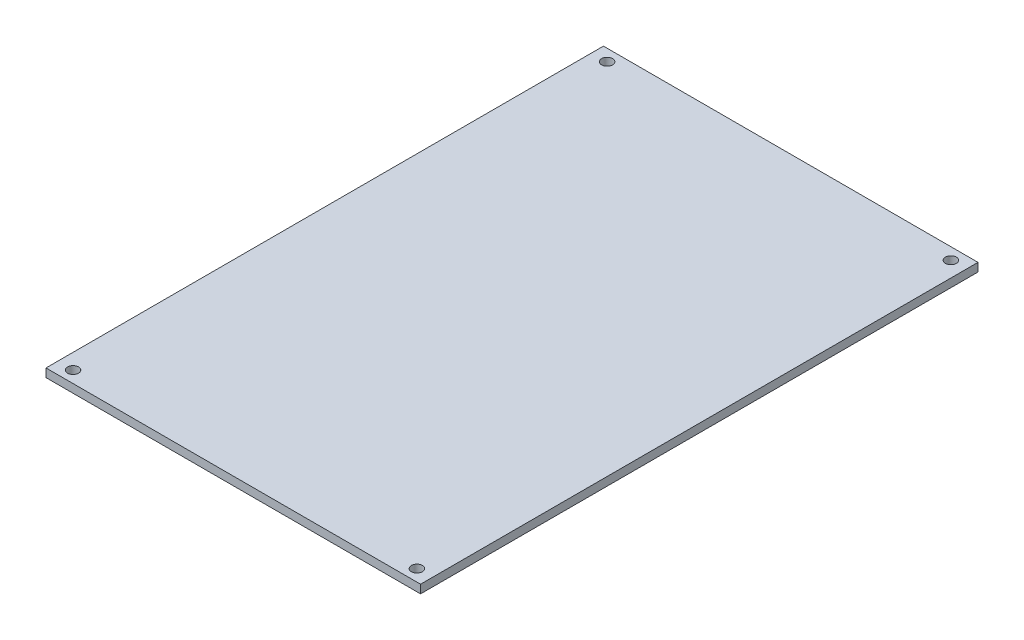
ISO-10303-21;
HEADER;
FILE_DESCRIPTION(('STEP AP214'),'2;1');
FILE_NAME('part.step','',(''),(''),'','','');
FILE_SCHEMA(('AUTOMOTIVE_DESIGN { 1 0 10303 214 1 1 1 1 }'));
ENDSEC;
DATA;
#1=APPLICATION_CONTEXT('core data for automotive mechanical design processes');
#2=APPLICATION_PROTOCOL_DEFINITION('international standard','automotive_design',2000,#1);
#3=PRODUCT_CONTEXT('',#1,'mechanical');
#4=PRODUCT('Part','Part','',(#3));
#5=PRODUCT_RELATED_PRODUCT_CATEGORY('part','',(#4));
#6=PRODUCT_DEFINITION_FORMATION('','',#4);
#7=PRODUCT_DEFINITION_CONTEXT('part definition',#1,'design');
#8=PRODUCT_DEFINITION('design','',#6,#7);
#9=PRODUCT_DEFINITION_SHAPE('','',#8);
#10=(LENGTH_UNIT() NAMED_UNIT(*) SI_UNIT(.MILLI.,.METRE.));
#11=(NAMED_UNIT(*) PLANE_ANGLE_UNIT() SI_UNIT($,.RADIAN.));
#12=(NAMED_UNIT(*) SI_UNIT($,.STERADIAN.) SOLID_ANGLE_UNIT());
#13=UNCERTAINTY_MEASURE_WITH_UNIT(LENGTH_MEASURE(1.E-05),#10,'distance_accuracy_value','');
#14=(GEOMETRIC_REPRESENTATION_CONTEXT(3) GLOBAL_UNCERTAINTY_ASSIGNED_CONTEXT((#13)) GLOBAL_UNIT_ASSIGNED_CONTEXT((#10,
#11,#12)) REPRESENTATION_CONTEXT('',''));
#15=CARTESIAN_POINT('',(0.,0.,0.));
#16=DIRECTION('',(0.,0.,1.));
#17=DIRECTION('',(1.,0.,0.));
#18=AXIS2_PLACEMENT_3D('',#15,#16,#17);
#19=CARTESIAN_POINT('',(51.2,2.3,76.2));
#20=DIRECTION('',(-1.,0.,0.));
#21=DIRECTION('',(0.,0.,1.));
#22=AXIS2_PLACEMENT_3D('',#19,#20,#21);
#23=PLANE('',#22);
#24=DIRECTION('',(0.,0.,-1.));
#25=VECTOR('',#24,1.);
#26=CARTESIAN_POINT('',(51.2,0.,76.2));
#27=LINE('',#26,#25);
#28=CARTESIAN_POINT('',(51.2,0.,76.2));
#29=VERTEX_POINT('',#28);
#30=CARTESIAN_POINT('',(51.2,0.,-76.2));
#31=VERTEX_POINT('',#30);
#32=EDGE_CURVE('E97',#29,#31,#27,.T.);
#33=ORIENTED_EDGE('',*,*,#32,.T.);
#34=DIRECTION('',(0.,-1.,0.));
#35=VECTOR('',#34,1.);
#36=CARTESIAN_POINT('',(51.2,2.3,-76.2));
#37=LINE('',#36,#35);
#38=CARTESIAN_POINT('',(51.2,2.3,-76.2));
#39=VERTEX_POINT('',#38);
#40=EDGE_CURVE('E11',#39,#31,#37,.T.);
#41=ORIENTED_EDGE('',*,*,#40,.F.);
#42=DIRECTION('',(0.,0.,-1.));
#43=VECTOR('',#42,1.);
#44=CARTESIAN_POINT('',(51.2,2.3,76.2));
#45=LINE('',#44,#43);
#46=CARTESIAN_POINT('',(51.2,2.3,76.2));
#47=VERTEX_POINT('',#46);
#48=EDGE_CURVE('E85',#47,#39,#45,.T.);
#49=ORIENTED_EDGE('',*,*,#48,.F.);
#50=DIRECTION('',(0.,-1.,0.));
#51=VECTOR('',#50,1.);
#52=CARTESIAN_POINT('',(51.2,2.3,76.2));
#53=LINE('',#52,#51);
#54=EDGE_CURVE('E93',#47,#29,#53,.T.);
#55=ORIENTED_EDGE('',*,*,#54,.T.);
#56=EDGE_LOOP('',(#33,#41,#49,#55));
#57=FACE_BOUND('',#56,.T.);
#58=ADVANCED_FACE('F34',(#57),#23,.F.);
#59=CARTESIAN_POINT('',(-51.2,2.3,-76.2));
#60=DIRECTION('',(0.,0.,1.));
#61=DIRECTION('',(1.,0.,0.));
#62=AXIS2_PLACEMENT_3D('',#59,#60,#61);
#63=PLANE('',#62);
#64=DIRECTION('',(-1.,0.,0.));
#65=VECTOR('',#64,1.);
#66=CARTESIAN_POINT('',(-51.2,0.,-76.2));
#67=LINE('',#66,#65);
#68=CARTESIAN_POINT('',(-51.2,0.,-76.2));
#69=VERTEX_POINT('',#68);
#70=EDGE_CURVE('E89',#31,#69,#67,.T.);
#71=ORIENTED_EDGE('',*,*,#70,.T.);
#72=DIRECTION('',(0.,-1.,0.));
#73=VECTOR('',#72,1.);
#74=CARTESIAN_POINT('',(-51.2,2.3,-76.2));
#75=LINE('',#74,#73);
#76=CARTESIAN_POINT('',(-51.2,2.3,-76.2));
#77=VERTEX_POINT('',#76);
#78=EDGE_CURVE('E42',#77,#69,#75,.T.);
#79=ORIENTED_EDGE('',*,*,#78,.F.);
#80=DIRECTION('',(-1.,0.,0.));
#81=VECTOR('',#80,1.);
#82=CARTESIAN_POINT('',(-51.2,2.3,-76.2));
#83=LINE('',#82,#81);
#84=EDGE_CURVE('E80',#39,#77,#83,.T.);
#85=ORIENTED_EDGE('',*,*,#84,.F.);
#86=ORIENTED_EDGE('',*,*,#40,.T.);
#87=EDGE_LOOP('',(#71,#79,#85,#86));
#88=FACE_BOUND('',#87,.T.);
#89=ADVANCED_FACE('F88',(#88),#63,.F.);
#90=CARTESIAN_POINT('',(-51.2,2.3,76.2));
#91=DIRECTION('',(1.,0.,0.));
#92=DIRECTION('',(0.,0.,-1.));
#93=AXIS2_PLACEMENT_3D('',#90,#91,#92);
#94=PLANE('',#93);
#95=DIRECTION('',(0.,0.,1.));
#96=VECTOR('',#95,1.);
#97=CARTESIAN_POINT('',(-51.2,0.,76.2));
#98=LINE('',#97,#96);
#99=CARTESIAN_POINT('',(-51.2,0.,76.2));
#100=VERTEX_POINT('',#99);
#101=EDGE_CURVE('E67',#69,#100,#98,.T.);
#102=ORIENTED_EDGE('',*,*,#101,.T.);
#103=DIRECTION('',(0.,-1.,0.));
#104=VECTOR('',#103,1.);
#105=CARTESIAN_POINT('',(-51.2,2.3,76.2));
#106=LINE('',#105,#104);
#107=CARTESIAN_POINT('',(-51.2,2.3,76.2));
#108=VERTEX_POINT('',#107);
#109=EDGE_CURVE('E90',#108,#100,#106,.T.);
#110=ORIENTED_EDGE('',*,*,#109,.F.);
#111=DIRECTION('',(0.,0.,1.));
#112=VECTOR('',#111,1.);
#113=CARTESIAN_POINT('',(-51.2,2.3,76.2));
#114=LINE('',#113,#112);
#115=EDGE_CURVE('E83',#77,#108,#114,.T.);
#116=ORIENTED_EDGE('',*,*,#115,.F.);
#117=ORIENTED_EDGE('',*,*,#78,.T.);
#118=EDGE_LOOP('',(#102,#110,#116,#117));
#119=FACE_BOUND('',#118,.T.);
#120=ADVANCED_FACE('F91',(#119),#94,.F.);
#121=CARTESIAN_POINT('',(-51.2,2.3,76.2));
#122=DIRECTION('',(0.,0.,-1.));
#123=DIRECTION('',(-1.,0.,0.));
#124=AXIS2_PLACEMENT_3D('',#121,#122,#123);
#125=PLANE('',#124);
#126=DIRECTION('',(1.,0.,0.));
#127=VECTOR('',#126,1.);
#128=CARTESIAN_POINT('',(-51.2,0.,76.2));
#129=LINE('',#128,#127);
#130=EDGE_CURVE('E73',#100,#29,#129,.T.);
#131=ORIENTED_EDGE('',*,*,#130,.T.);
#132=ORIENTED_EDGE('',*,*,#54,.F.);
#133=DIRECTION('',(1.,0.,0.));
#134=VECTOR('',#133,1.);
#135=CARTESIAN_POINT('',(-51.2,2.3,76.2));
#136=LINE('',#135,#134);
#137=EDGE_CURVE('E50',#108,#47,#136,.T.);
#138=ORIENTED_EDGE('',*,*,#137,.F.);
#139=ORIENTED_EDGE('',*,*,#109,.T.);
#140=EDGE_LOOP('',(#131,#132,#138,#139));
#141=FACE_BOUND('',#140,.T.);
#142=ADVANCED_FACE('F105',(#141),#125,.F.);
#143=CARTESIAN_POINT('',(0.,2.3,0.));
#144=DIRECTION('',(0.,-1.,0.));
#145=DIRECTION('',(0.,0.,-1.));
#146=AXIS2_PLACEMENT_3D('',#143,#144,#145);
#147=PLANE('',#146);
#148=CARTESIAN_POINT('',(47.,2.3,-73.));
#149=DIRECTION('',(0.,1.,0.));
#150=DIRECTION('',(0.,0.,-1.));
#151=AXIS2_PLACEMENT_3D('',#148,#149,#150);
#152=CIRCLE('',#151,1.5);
#153=CARTESIAN_POINT('',(47.,2.3,-74.5));
#154=VERTEX_POINT('',#153);
#155=EDGE_CURVE('E129',#154,#154,#152,.T.);
#156=ORIENTED_EDGE('',*,*,#155,.F.);
#157=EDGE_LOOP('',(#156));
#158=FACE_BOUND('',#157,.T.);
#159=CARTESIAN_POINT('',(47.,2.3,73.));
#160=DIRECTION('',(0.,1.,0.));
#161=DIRECTION('',(0.,0.,1.));
#162=AXIS2_PLACEMENT_3D('',#159,#160,#161);
#163=CIRCLE('',#162,1.5);
#164=CARTESIAN_POINT('',(47.,2.3,74.5));
#165=VERTEX_POINT('',#164);
#166=EDGE_CURVE('E123',#165,#165,#163,.T.);
#167=ORIENTED_EDGE('',*,*,#166,.F.);
#168=EDGE_LOOP('',(#167));
#169=FACE_BOUND('',#168,.T.);
#170=CARTESIAN_POINT('',(-47.,2.3,73.));
#171=DIRECTION('',(0.,1.,0.));
#172=DIRECTION('',(0.,0.,-1.));
#173=AXIS2_PLACEMENT_3D('',#170,#171,#172);
#174=CIRCLE('',#173,1.5);
#175=CARTESIAN_POINT('',(-47.,2.3,71.5));
#176=VERTEX_POINT('',#175);
#177=EDGE_CURVE('E117',#176,#176,#174,.T.);
#178=ORIENTED_EDGE('',*,*,#177,.F.);
#179=EDGE_LOOP('',(#178));
#180=FACE_BOUND('',#179,.T.);
#181=CARTESIAN_POINT('',(-47.,2.3,-73.));
#182=DIRECTION('',(0.,1.,0.));
#183=DIRECTION('',(0.,0.,1.));
#184=AXIS2_PLACEMENT_3D('',#181,#182,#183);
#185=CIRCLE('',#184,1.5);
#186=CARTESIAN_POINT('',(-47.,2.3,-71.5));
#187=VERTEX_POINT('',#186);
#188=EDGE_CURVE('E111',#187,#187,#185,.T.);
#189=ORIENTED_EDGE('',*,*,#188,.F.);
#190=EDGE_LOOP('',(#189));
#191=FACE_BOUND('',#190,.T.);
#192=ORIENTED_EDGE('',*,*,#48,.T.);
#193=ORIENTED_EDGE('',*,*,#84,.T.);
#194=ORIENTED_EDGE('',*,*,#115,.T.);
#195=ORIENTED_EDGE('',*,*,#137,.T.);
#196=EDGE_LOOP('',(#192,#193,#194,#195));
#197=FACE_BOUND('',#196,.T.);
#198=ADVANCED_FACE('F81',(#158,#169,#180,#191,#197),#147,.F.);
#199=CARTESIAN_POINT('',(0.,0.,0.));
#200=DIRECTION('',(0.,-1.,0.));
#201=DIRECTION('',(0.,0.,-1.));
#202=AXIS2_PLACEMENT_3D('',#199,#200,#201);
#203=PLANE('',#202);
#204=CARTESIAN_POINT('',(47.,0.,-73.));
#205=DIRECTION('',(0.,1.,0.));
#206=DIRECTION('',(0.,0.,-1.));
#207=AXIS2_PLACEMENT_3D('',#204,#205,#206);
#208=CIRCLE('',#207,1.5);
#209=CARTESIAN_POINT('',(47.,0.,-74.5));
#210=VERTEX_POINT('',#209);
#211=EDGE_CURVE('E114',#210,#210,#208,.T.);
#212=ORIENTED_EDGE('',*,*,#211,.T.);
#213=EDGE_LOOP('',(#212));
#214=FACE_BOUND('',#213,.T.);
#215=CARTESIAN_POINT('',(47.,0.,73.));
#216=DIRECTION('',(0.,1.,0.));
#217=DIRECTION('',(0.,0.,1.));
#218=AXIS2_PLACEMENT_3D('',#215,#216,#217);
#219=CIRCLE('',#218,1.5);
#220=CARTESIAN_POINT('',(47.,0.,74.5));
#221=VERTEX_POINT('',#220);
#222=EDGE_CURVE('E126',#221,#221,#219,.T.);
#223=ORIENTED_EDGE('',*,*,#222,.T.);
#224=EDGE_LOOP('',(#223));
#225=FACE_BOUND('',#224,.T.);
#226=CARTESIAN_POINT('',(-47.,0.,73.));
#227=DIRECTION('',(0.,1.,0.));
#228=DIRECTION('',(0.,0.,-1.));
#229=AXIS2_PLACEMENT_3D('',#226,#227,#228);
#230=CIRCLE('',#229,1.5);
#231=CARTESIAN_POINT('',(-47.,0.,71.5));
#232=VERTEX_POINT('',#231);
#233=EDGE_CURVE('E120',#232,#232,#230,.T.);
#234=ORIENTED_EDGE('',*,*,#233,.T.);
#235=EDGE_LOOP('',(#234));
#236=FACE_BOUND('',#235,.T.);
#237=CARTESIAN_POINT('',(-47.,0.,-73.));
#238=DIRECTION('',(0.,1.,0.));
#239=DIRECTION('',(0.,0.,1.));
#240=AXIS2_PLACEMENT_3D('',#237,#238,#239);
#241=CIRCLE('',#240,1.5);
#242=CARTESIAN_POINT('',(-47.,0.,-71.5));
#243=VERTEX_POINT('',#242);
#244=EDGE_CURVE('E100',#243,#243,#241,.T.);
#245=ORIENTED_EDGE('',*,*,#244,.T.);
#246=EDGE_LOOP('',(#245));
#247=FACE_BOUND('',#246,.T.);
#248=ORIENTED_EDGE('',*,*,#32,.F.);
#249=ORIENTED_EDGE('',*,*,#130,.F.);
#250=ORIENTED_EDGE('',*,*,#101,.F.);
#251=ORIENTED_EDGE('',*,*,#70,.F.);
#252=EDGE_LOOP('',(#248,#249,#250,#251));
#253=FACE_BOUND('',#252,.T.);
#254=ADVANCED_FACE('F108',(#214,#225,#236,#247,#253),#203,.T.);
#255=CARTESIAN_POINT('',(-47.,0.,-73.));
#256=DIRECTION('',(0.,1.,0.));
#257=DIRECTION('',(0.,0.,1.));
#258=AXIS2_PLACEMENT_3D('',#255,#256,#257);
#259=CYLINDRICAL_SURFACE('',#258,1.5);
#260=ORIENTED_EDGE('',*,*,#244,.F.);
#261=EDGE_LOOP('',(#260));
#262=FACE_BOUND('',#261,.T.);
#263=ORIENTED_EDGE('',*,*,#188,.T.);
#264=EDGE_LOOP('',(#263));
#265=FACE_BOUND('',#264,.T.);
#266=ADVANCED_FACE('F153',(#262,#265),#259,.F.);
#267=CARTESIAN_POINT('',(-47.,0.,73.));
#268=DIRECTION('',(0.,1.,0.));
#269=DIRECTION('',(0.,0.,1.));
#270=AXIS2_PLACEMENT_3D('',#267,#268,#269);
#271=CYLINDRICAL_SURFACE('',#270,1.5);
#272=ORIENTED_EDGE('',*,*,#233,.F.);
#273=EDGE_LOOP('',(#272));
#274=FACE_BOUND('',#273,.T.);
#275=ORIENTED_EDGE('',*,*,#177,.T.);
#276=EDGE_LOOP('',(#275));
#277=FACE_BOUND('',#276,.T.);
#278=ADVANCED_FACE('F155',(#274,#277),#271,.F.);
#279=CARTESIAN_POINT('',(47.,0.,73.));
#280=DIRECTION('',(0.,1.,0.));
#281=DIRECTION('',(0.,0.,1.));
#282=AXIS2_PLACEMENT_3D('',#279,#280,#281);
#283=CYLINDRICAL_SURFACE('',#282,1.5);
#284=ORIENTED_EDGE('',*,*,#222,.F.);
#285=EDGE_LOOP('',(#284));
#286=FACE_BOUND('',#285,.T.);
#287=ORIENTED_EDGE('',*,*,#166,.T.);
#288=EDGE_LOOP('',(#287));
#289=FACE_BOUND('',#288,.T.);
#290=ADVANCED_FACE('F140',(#286,#289),#283,.F.);
#291=CARTESIAN_POINT('',(47.,0.,-73.));
#292=DIRECTION('',(0.,1.,0.));
#293=DIRECTION('',(0.,0.,1.));
#294=AXIS2_PLACEMENT_3D('',#291,#292,#293);
#295=CYLINDRICAL_SURFACE('',#294,1.5);
#296=ORIENTED_EDGE('',*,*,#211,.F.);
#297=EDGE_LOOP('',(#296));
#298=FACE_BOUND('',#297,.T.);
#299=ORIENTED_EDGE('',*,*,#155,.T.);
#300=EDGE_LOOP('',(#299));
#301=FACE_BOUND('',#300,.T.);
#302=ADVANCED_FACE('F137',(#298,#301),#295,.F.);
#303=CLOSED_SHELL('',(#58,#89,#120,#142,#198,#254,#266,#278,#290,#302));
#304=MANIFOLD_SOLID_BREP('B2',#303);
#305=ADVANCED_BREP_SHAPE_REPRESENTATION('',(#18,#304),#14);
#306=SHAPE_DEFINITION_REPRESENTATION(#9,#305);
ENDSEC;
END-ISO-10303-21;
